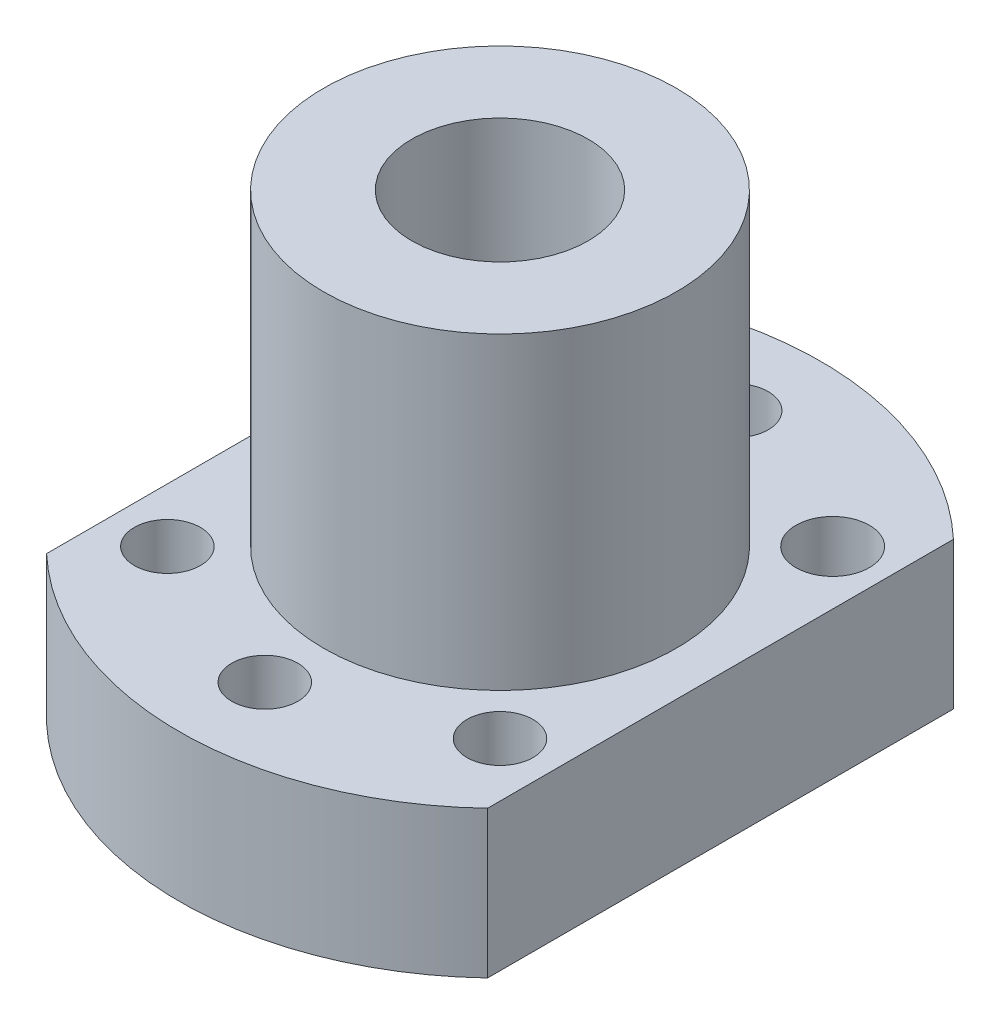
ISO-10303-21;
HEADER;
FILE_DESCRIPTION(('STEP AP214'),'2;1');
FILE_NAME('part.step','',(''),(''),'','','');
FILE_SCHEMA(('AUTOMOTIVE_DESIGN { 1 0 10303 214 1 1 1 1 }'));
ENDSEC;
DATA;
#1=APPLICATION_CONTEXT('core data for automotive mechanical design processes');
#2=APPLICATION_PROTOCOL_DEFINITION('international standard','automotive_design',2000,#1);
#3=PRODUCT_CONTEXT('',#1,'mechanical');
#4=PRODUCT('Part','Part','',(#3));
#5=PRODUCT_RELATED_PRODUCT_CATEGORY('part','',(#4));
#6=PRODUCT_DEFINITION_FORMATION('','',#4);
#7=PRODUCT_DEFINITION_CONTEXT('part definition',#1,'design');
#8=PRODUCT_DEFINITION('design','',#6,#7);
#9=PRODUCT_DEFINITION_SHAPE('','',#8);
#10=(LENGTH_UNIT() NAMED_UNIT(*) SI_UNIT(.MILLI.,.METRE.));
#11=(NAMED_UNIT(*) PLANE_ANGLE_UNIT() SI_UNIT($,.RADIAN.));
#12=(NAMED_UNIT(*) SI_UNIT($,.STERADIAN.) SOLID_ANGLE_UNIT());
#13=UNCERTAINTY_MEASURE_WITH_UNIT(LENGTH_MEASURE(1.E-05),#10,'distance_accuracy_value','');
#14=(GEOMETRIC_REPRESENTATION_CONTEXT(3) GLOBAL_UNCERTAINTY_ASSIGNED_CONTEXT((#13)) GLOBAL_UNIT_ASSIGNED_CONTEXT((#10,
#11,#12)) REPRESENTATION_CONTEXT('',''));
#15=CARTESIAN_POINT('',(0.,0.,0.));
#16=DIRECTION('',(0.,0.,1.));
#17=DIRECTION('',(1.,0.,0.));
#18=AXIS2_PLACEMENT_3D('',#15,#16,#17);
#19=CARTESIAN_POINT('',(0.,10.,0.));
#20=DIRECTION('',(0.,1.,0.));
#21=DIRECTION('',(0.,0.,1.));
#22=AXIS2_PLACEMENT_3D('',#19,#20,#21);
#23=PLANE('',#22);
#24=CARTESIAN_POINT('',(11.3137084989848,10.,11.3137084989847));
#25=DIRECTION('',(0.,1.,0.));
#26=DIRECTION('',(0.,0.,1.));
#27=AXIS2_PLACEMENT_3D('',#24,#25,#26);
#28=CIRCLE('',#27,2.25);
#29=CARTESIAN_POINT('',(11.3137084989848,10.,13.5637084989847));
#30=VERTEX_POINT('',#29);
#31=EDGE_CURVE('E121',#30,#30,#28,.T.);
#32=ORIENTED_EDGE('',*,*,#31,.F.);
#33=EDGE_LOOP('',(#32));
#34=FACE_BOUND('',#33,.T.);
#35=CARTESIAN_POINT('',(0.,10.,16.));
#36=DIRECTION('',(0.,1.,0.));
#37=DIRECTION('',(0.,0.,1.));
#38=AXIS2_PLACEMENT_3D('',#35,#36,#37);
#39=CIRCLE('',#38,2.25);
#40=CARTESIAN_POINT('',(0.,10.,18.25));
#41=VERTEX_POINT('',#40);
#42=EDGE_CURVE('E118',#41,#41,#39,.T.);
#43=ORIENTED_EDGE('',*,*,#42,.F.);
#44=EDGE_LOOP('',(#43));
#45=FACE_BOUND('',#44,.T.);
#46=CARTESIAN_POINT('',(-11.3137084989848,10.,11.3137084989847));
#47=DIRECTION('',(0.,1.,0.));
#48=DIRECTION('',(0.,0.,1.));
#49=AXIS2_PLACEMENT_3D('',#46,#47,#48);
#50=CIRCLE('',#49,2.25);
#51=CARTESIAN_POINT('',(-11.3137084989848,10.,13.5637084989847));
#52=VERTEX_POINT('',#51);
#53=EDGE_CURVE('E115',#52,#52,#50,.T.);
#54=ORIENTED_EDGE('',*,*,#53,.F.);
#55=EDGE_LOOP('',(#54));
#56=FACE_BOUND('',#55,.T.);
#57=CARTESIAN_POINT('',(-11.3137084989848,10.,-11.3137084989847));
#58=DIRECTION('',(0.,1.,0.));
#59=DIRECTION('',(0.,0.,1.));
#60=AXIS2_PLACEMENT_3D('',#57,#58,#59);
#61=CIRCLE('',#60,2.25);
#62=CARTESIAN_POINT('',(-11.3137084989848,10.,-9.06370849898473));
#63=VERTEX_POINT('',#62);
#64=EDGE_CURVE('E112',#63,#63,#61,.T.);
#65=ORIENTED_EDGE('',*,*,#64,.F.);
#66=EDGE_LOOP('',(#65));
#67=FACE_BOUND('',#66,.T.);
#68=CARTESIAN_POINT('',(0.,10.,-16.));
#69=DIRECTION('',(0.,1.,0.));
#70=DIRECTION('',(0.,0.,1.));
#71=AXIS2_PLACEMENT_3D('',#68,#69,#70);
#72=CIRCLE('',#71,2.25);
#73=CARTESIAN_POINT('',(0.,10.,-13.75));
#74=VERTEX_POINT('',#73);
#75=EDGE_CURVE('E109',#74,#74,#72,.T.);
#76=ORIENTED_EDGE('',*,*,#75,.F.);
#77=EDGE_LOOP('',(#76));
#78=FACE_BOUND('',#77,.T.);
#79=CARTESIAN_POINT('',(11.3137084989848,10.,-11.3137084989847));
#80=DIRECTION('',(0.,1.,0.));
#81=DIRECTION('',(0.,0.,1.));
#82=AXIS2_PLACEMENT_3D('',#79,#80,#81);
#83=CIRCLE('',#82,2.5);
#84=CARTESIAN_POINT('',(11.3137084989848,10.,-8.81370849898474));
#85=VERTEX_POINT('',#84);
#86=EDGE_CURVE('E106',#85,#85,#83,.T.);
#87=ORIENTED_EDGE('',*,*,#86,.F.);
#88=EDGE_LOOP('',(#87));
#89=FACE_BOUND('',#88,.T.);
#90=CARTESIAN_POINT('',(0.,10.,0.));
#91=DIRECTION('',(0.,1.,0.));
#92=DIRECTION('',(0.,0.,1.));
#93=AXIS2_PLACEMENT_3D('',#90,#91,#92);
#94=CIRCLE('',#93,21.8198063393168);
#95=CARTESIAN_POINT('',(-15.,10.,15.8462597695889));
#96=VERTEX_POINT('',#95);
#97=CARTESIAN_POINT('',(15.,10.,15.8462597695889));
#98=VERTEX_POINT('',#97);
#99=EDGE_CURVE('E84',#96,#98,#94,.T.);
#100=ORIENTED_EDGE('',*,*,#99,.T.);
#101=DIRECTION('',(0.,0.,1.));
#102=VECTOR('',#101,1.);
#103=CARTESIAN_POINT('',(15.,10.,0.));
#104=LINE('',#103,#102);
#105=CARTESIAN_POINT('',(15.,10.,-15.8462597695889));
#106=VERTEX_POINT('',#105);
#107=EDGE_CURVE('E92',#106,#98,#104,.T.);
#108=ORIENTED_EDGE('',*,*,#107,.F.);
#109=CARTESIAN_POINT('',(0.,10.,0.));
#110=DIRECTION('',(0.,1.,0.));
#111=DIRECTION('',(0.,0.,1.));
#112=AXIS2_PLACEMENT_3D('',#109,#110,#111);
#113=CIRCLE('',#112,21.8198063393168);
#114=CARTESIAN_POINT('',(-15.,10.,-15.8462597695889));
#115=VERTEX_POINT('',#114);
#116=EDGE_CURVE('E96',#106,#115,#113,.T.);
#117=ORIENTED_EDGE('',*,*,#116,.T.);
#118=DIRECTION('',(0.,0.,1.));
#119=VECTOR('',#118,1.);
#120=CARTESIAN_POINT('',(-15.,10.,0.));
#121=LINE('',#120,#119);
#122=EDGE_CURVE('E58',#115,#96,#121,.T.);
#123=ORIENTED_EDGE('',*,*,#122,.T.);
#124=EDGE_LOOP('',(#100,#108,#117,#123));
#125=FACE_BOUND('',#124,.T.);
#126=CARTESIAN_POINT('',(0.,10.,0.));
#127=DIRECTION('',(0.,1.,0.));
#128=DIRECTION('',(0.,0.,1.));
#129=AXIS2_PLACEMENT_3D('',#126,#127,#128);
#130=CIRCLE('',#129,12.);
#131=CARTESIAN_POINT('',(0.,10.,12.));
#132=VERTEX_POINT('',#131);
#133=EDGE_CURVE('E348',#132,#132,#130,.T.);
#134=ORIENTED_EDGE('',*,*,#133,.F.);
#135=EDGE_LOOP('',(#134));
#136=FACE_BOUND('',#135,.T.);
#137=ADVANCED_FACE('F41',(#34,#45,#56,#67,#78,#89,#125,#136),#23,.T.);
#138=CARTESIAN_POINT('',(0.,10.,0.));
#139=DIRECTION('',(0.,-1.,0.));
#140=DIRECTION('',(0.,0.,-1.));
#141=AXIS2_PLACEMENT_3D('',#138,#139,#140);
#142=CYLINDRICAL_SURFACE('',#141,21.8198063393168);
#143=CARTESIAN_POINT('',(0.,0.,0.));
#144=DIRECTION('',(0.,1.,0.));
#145=DIRECTION('',(0.,0.,1.));
#146=AXIS2_PLACEMENT_3D('',#143,#144,#145);
#147=CIRCLE('',#146,21.8198063393168);
#148=CARTESIAN_POINT('',(-15.,0.,15.8462597695889));
#149=VERTEX_POINT('',#148);
#150=CARTESIAN_POINT('',(15.,0.,15.8462597695889));
#151=VERTEX_POINT('',#150);
#152=EDGE_CURVE('E125',#149,#151,#147,.T.);
#153=ORIENTED_EDGE('',*,*,#152,.T.);
#154=DIRECTION('',(0.,-1.,0.));
#155=VECTOR('',#154,1.);
#156=CARTESIAN_POINT('',(15.,10.,15.8462597695889));
#157=LINE('',#156,#155);
#158=EDGE_CURVE('E11',#98,#151,#157,.T.);
#159=ORIENTED_EDGE('',*,*,#158,.F.);
#160=ORIENTED_EDGE('',*,*,#99,.F.);
#161=DIRECTION('',(0.,-1.,0.));
#162=VECTOR('',#161,1.);
#163=CARTESIAN_POINT('',(-15.,10.,15.8462597695889));
#164=LINE('',#163,#162);
#165=EDGE_CURVE('E124',#96,#149,#164,.T.);
#166=ORIENTED_EDGE('',*,*,#165,.T.);
#167=EDGE_LOOP('',(#153,#159,#160,#166));
#168=FACE_BOUND('',#167,.T.);
#169=ADVANCED_FACE('F43',(#168),#142,.T.);
#170=CARTESIAN_POINT('',(15.,10.,0.));
#171=DIRECTION('',(1.,0.,0.));
#172=DIRECTION('',(0.,0.,-1.));
#173=AXIS2_PLACEMENT_3D('',#170,#171,#172);
#174=PLANE('',#173);
#175=DIRECTION('',(0.,0.,1.));
#176=VECTOR('',#175,1.);
#177=CARTESIAN_POINT('',(15.,0.,0.));
#178=LINE('',#177,#176);
#179=CARTESIAN_POINT('',(15.,0.,-15.8462597695889));
#180=VERTEX_POINT('',#179);
#181=EDGE_CURVE('E94',#180,#151,#178,.T.);
#182=ORIENTED_EDGE('',*,*,#181,.F.);
#183=DIRECTION('',(0.,-1.,0.));
#184=VECTOR('',#183,1.);
#185=CARTESIAN_POINT('',(15.,10.,-15.8462597695889));
#186=LINE('',#185,#184);
#187=EDGE_CURVE('E50',#106,#180,#186,.T.);
#188=ORIENTED_EDGE('',*,*,#187,.F.);
#189=ORIENTED_EDGE('',*,*,#107,.T.);
#190=ORIENTED_EDGE('',*,*,#158,.T.);
#191=EDGE_LOOP('',(#182,#188,#189,#190));
#192=FACE_BOUND('',#191,.T.);
#193=ADVANCED_FACE('F91',(#192),#174,.T.);
#194=CARTESIAN_POINT('',(0.,10.,0.));
#195=DIRECTION('',(0.,-1.,0.));
#196=DIRECTION('',(0.,0.,-1.));
#197=AXIS2_PLACEMENT_3D('',#194,#195,#196);
#198=CYLINDRICAL_SURFACE('',#197,21.8198063393168);
#199=CARTESIAN_POINT('',(0.,0.,0.));
#200=DIRECTION('',(0.,1.,0.));
#201=DIRECTION('',(0.,0.,1.));
#202=AXIS2_PLACEMENT_3D('',#199,#200,#201);
#203=CIRCLE('',#202,21.8198063393168);
#204=CARTESIAN_POINT('',(-15.,0.,-15.8462597695889));
#205=VERTEX_POINT('',#204);
#206=EDGE_CURVE('E73',#180,#205,#203,.T.);
#207=ORIENTED_EDGE('',*,*,#206,.T.);
#208=DIRECTION('',(0.,-1.,0.));
#209=VECTOR('',#208,1.);
#210=CARTESIAN_POINT('',(-15.,10.,-15.8462597695889));
#211=LINE('',#210,#209);
#212=EDGE_CURVE('E95',#115,#205,#211,.T.);
#213=ORIENTED_EDGE('',*,*,#212,.F.);
#214=ORIENTED_EDGE('',*,*,#116,.F.);
#215=ORIENTED_EDGE('',*,*,#187,.T.);
#216=EDGE_LOOP('',(#207,#213,#214,#215));
#217=FACE_BOUND('',#216,.T.);
#218=ADVANCED_FACE('F97',(#217),#198,.T.);
#219=CARTESIAN_POINT('',(0.,10.,0.));
#220=DIRECTION('',(0.,-1.,0.));
#221=DIRECTION('',(0.,0.,-1.));
#222=AXIS2_PLACEMENT_3D('',#219,#220,#221);
#223=CYLINDRICAL_SURFACE('',#222,6.);
#224=CARTESIAN_POINT('',(0.,0.,0.));
#225=DIRECTION('',(0.,1.,0.));
#226=DIRECTION('',(0.,0.,1.));
#227=AXIS2_PLACEMENT_3D('',#224,#225,#226);
#228=CIRCLE('',#227,6.);
#229=CARTESIAN_POINT('',(0.,0.,6.));
#230=VERTEX_POINT('',#229);
#231=EDGE_CURVE('E147',#230,#230,#228,.T.);
#232=ORIENTED_EDGE('',*,*,#231,.F.);
#233=EDGE_LOOP('',(#232));
#234=FACE_BOUND('',#233,.T.);
#235=CARTESIAN_POINT('',(0.,31.,0.));
#236=DIRECTION('',(0.,1.,0.));
#237=DIRECTION('',(0.,0.,1.));
#238=AXIS2_PLACEMENT_3D('',#235,#236,#237);
#239=CIRCLE('',#238,6.);
#240=CARTESIAN_POINT('',(0.,31.,6.));
#241=VERTEX_POINT('',#240);
#242=EDGE_CURVE('E349',#241,#241,#239,.T.);
#243=ORIENTED_EDGE('',*,*,#242,.T.);
#244=EDGE_LOOP('',(#243));
#245=FACE_BOUND('',#244,.T.);
#246=ADVANCED_FACE('F181',(#234,#245),#223,.F.);
#247=CARTESIAN_POINT('',(0.,10.,16.));
#248=DIRECTION('',(0.,-1.,0.));
#249=DIRECTION('',(0.,0.,-1.));
#250=AXIS2_PLACEMENT_3D('',#247,#248,#249);
#251=CYLINDRICAL_SURFACE('',#250,2.25);
#252=ORIENTED_EDGE('',*,*,#42,.T.);
#253=EDGE_LOOP('',(#252));
#254=FACE_BOUND('',#253,.T.);
#255=CARTESIAN_POINT('',(0.,0.,16.));
#256=DIRECTION('',(0.,1.,0.));
#257=DIRECTION('',(0.,0.,1.));
#258=AXIS2_PLACEMENT_3D('',#255,#256,#257);
#259=CIRCLE('',#258,2.25);
#260=CARTESIAN_POINT('',(0.,0.,18.25));
#261=VERTEX_POINT('',#260);
#262=EDGE_CURVE('E144',#261,#261,#259,.T.);
#263=ORIENTED_EDGE('',*,*,#262,.F.);
#264=EDGE_LOOP('',(#263));
#265=FACE_BOUND('',#264,.T.);
#266=ADVANCED_FACE('F184',(#254,#265),#251,.F.);
#267=CARTESIAN_POINT('',(-11.3137084989848,10.,11.3137084989847));
#268=DIRECTION('',(0.,-1.,0.));
#269=DIRECTION('',(0.,0.,-1.));
#270=AXIS2_PLACEMENT_3D('',#267,#268,#269);
#271=CYLINDRICAL_SURFACE('',#270,2.25);
#272=ORIENTED_EDGE('',*,*,#53,.T.);
#273=EDGE_LOOP('',(#272));
#274=FACE_BOUND('',#273,.T.);
#275=CARTESIAN_POINT('',(-11.3137084989848,0.,11.3137084989847));
#276=DIRECTION('',(0.,1.,0.));
#277=DIRECTION('',(0.,0.,1.));
#278=AXIS2_PLACEMENT_3D('',#275,#276,#277);
#279=CIRCLE('',#278,2.25);
#280=CARTESIAN_POINT('',(-11.3137084989848,0.,13.5637084989847));
#281=VERTEX_POINT('',#280);
#282=EDGE_CURVE('E141',#281,#281,#279,.T.);
#283=ORIENTED_EDGE('',*,*,#282,.F.);
#284=EDGE_LOOP('',(#283));
#285=FACE_BOUND('',#284,.T.);
#286=ADVANCED_FACE('F188',(#274,#285),#271,.F.);
#287=CARTESIAN_POINT('',(-11.3137084989848,10.,-11.3137084989847));
#288=DIRECTION('',(0.,-1.,0.));
#289=DIRECTION('',(0.,0.,-1.));
#290=AXIS2_PLACEMENT_3D('',#287,#288,#289);
#291=CYLINDRICAL_SURFACE('',#290,2.25);
#292=ORIENTED_EDGE('',*,*,#64,.T.);
#293=EDGE_LOOP('',(#292));
#294=FACE_BOUND('',#293,.T.);
#295=CARTESIAN_POINT('',(-11.3137084989848,0.,-11.3137084989847));
#296=DIRECTION('',(0.,1.,0.));
#297=DIRECTION('',(0.,0.,1.));
#298=AXIS2_PLACEMENT_3D('',#295,#296,#297);
#299=CIRCLE('',#298,2.25);
#300=CARTESIAN_POINT('',(-11.3137084989848,0.,-9.06370849898473));
#301=VERTEX_POINT('',#300);
#302=EDGE_CURVE('E138',#301,#301,#299,.T.);
#303=ORIENTED_EDGE('',*,*,#302,.F.);
#304=EDGE_LOOP('',(#303));
#305=FACE_BOUND('',#304,.T.);
#306=ADVANCED_FACE('F192',(#294,#305),#291,.F.);
#307=CARTESIAN_POINT('',(0.,10.,-16.));
#308=DIRECTION('',(0.,-1.,0.));
#309=DIRECTION('',(0.,0.,-1.));
#310=AXIS2_PLACEMENT_3D('',#307,#308,#309);
#311=CYLINDRICAL_SURFACE('',#310,2.25);
#312=ORIENTED_EDGE('',*,*,#75,.T.);
#313=EDGE_LOOP('',(#312));
#314=FACE_BOUND('',#313,.T.);
#315=CARTESIAN_POINT('',(0.,0.,-16.));
#316=DIRECTION('',(0.,1.,0.));
#317=DIRECTION('',(0.,0.,1.));
#318=AXIS2_PLACEMENT_3D('',#315,#316,#317);
#319=CIRCLE('',#318,2.25);
#320=CARTESIAN_POINT('',(0.,0.,-13.75));
#321=VERTEX_POINT('',#320);
#322=EDGE_CURVE('E135',#321,#321,#319,.T.);
#323=ORIENTED_EDGE('',*,*,#322,.F.);
#324=EDGE_LOOP('',(#323));
#325=FACE_BOUND('',#324,.T.);
#326=ADVANCED_FACE('F196',(#314,#325),#311,.F.);
#327=CARTESIAN_POINT('',(11.3137084989848,10.,-11.3137084989847));
#328=DIRECTION('',(0.,-1.,0.));
#329=DIRECTION('',(0.,0.,-1.));
#330=AXIS2_PLACEMENT_3D('',#327,#328,#329);
#331=CYLINDRICAL_SURFACE('',#330,2.5);
#332=ORIENTED_EDGE('',*,*,#86,.T.);
#333=EDGE_LOOP('',(#332));
#334=FACE_BOUND('',#333,.T.);
#335=CARTESIAN_POINT('',(11.3137084989848,0.,-11.3137084989847));
#336=DIRECTION('',(0.,1.,0.));
#337=DIRECTION('',(0.,0.,1.));
#338=AXIS2_PLACEMENT_3D('',#335,#336,#337);
#339=CIRCLE('',#338,2.5);
#340=CARTESIAN_POINT('',(11.3137084989848,0.,-8.81370849898474));
#341=VERTEX_POINT('',#340);
#342=EDGE_CURVE('E132',#341,#341,#339,.T.);
#343=ORIENTED_EDGE('',*,*,#342,.F.);
#344=EDGE_LOOP('',(#343));
#345=FACE_BOUND('',#344,.T.);
#346=ADVANCED_FACE('F200',(#334,#345),#331,.F.);
#347=CARTESIAN_POINT('',(-15.,10.,0.));
#348=DIRECTION('',(1.,0.,0.));
#349=DIRECTION('',(0.,0.,-1.));
#350=AXIS2_PLACEMENT_3D('',#347,#348,#349);
#351=PLANE('',#350);
#352=DIRECTION('',(0.,0.,1.));
#353=VECTOR('',#352,1.);
#354=CARTESIAN_POINT('',(-15.,0.,0.));
#355=LINE('',#354,#353);
#356=EDGE_CURVE('E79',#205,#149,#355,.T.);
#357=ORIENTED_EDGE('',*,*,#356,.T.);
#358=ORIENTED_EDGE('',*,*,#165,.F.);
#359=ORIENTED_EDGE('',*,*,#122,.F.);
#360=ORIENTED_EDGE('',*,*,#212,.T.);
#361=EDGE_LOOP('',(#357,#358,#359,#360));
#362=FACE_BOUND('',#361,.T.);
#363=ADVANCED_FACE('F153',(#362),#351,.F.);
#364=CARTESIAN_POINT('',(11.3137084989848,10.,11.3137084989847));
#365=DIRECTION('',(0.,-1.,0.));
#366=DIRECTION('',(0.,0.,-1.));
#367=AXIS2_PLACEMENT_3D('',#364,#365,#366);
#368=CYLINDRICAL_SURFACE('',#367,2.25);
#369=ORIENTED_EDGE('',*,*,#31,.T.);
#370=EDGE_LOOP('',(#369));
#371=FACE_BOUND('',#370,.T.);
#372=CARTESIAN_POINT('',(11.3137084989848,0.,11.3137084989847));
#373=DIRECTION('',(0.,1.,0.));
#374=DIRECTION('',(0.,0.,1.));
#375=AXIS2_PLACEMENT_3D('',#372,#373,#374);
#376=CIRCLE('',#375,2.25);
#377=CARTESIAN_POINT('',(11.3137084989848,0.,13.5637084989847));
#378=VERTEX_POINT('',#377);
#379=EDGE_CURVE('E101',#378,#378,#376,.T.);
#380=ORIENTED_EDGE('',*,*,#379,.F.);
#381=EDGE_LOOP('',(#380));
#382=FACE_BOUND('',#381,.T.);
#383=ADVANCED_FACE('F177',(#371,#382),#368,.F.);
#384=CARTESIAN_POINT('',(0.,0.,0.));
#385=DIRECTION('',(0.,1.,0.));
#386=DIRECTION('',(0.,0.,1.));
#387=AXIS2_PLACEMENT_3D('',#384,#385,#386);
#388=PLANE('',#387);
#389=ORIENTED_EDGE('',*,*,#152,.F.);
#390=ORIENTED_EDGE('',*,*,#356,.F.);
#391=ORIENTED_EDGE('',*,*,#206,.F.);
#392=ORIENTED_EDGE('',*,*,#181,.T.);
#393=EDGE_LOOP('',(#389,#390,#391,#392));
#394=FACE_BOUND('',#393,.T.);
#395=ORIENTED_EDGE('',*,*,#342,.T.);
#396=EDGE_LOOP('',(#395));
#397=FACE_BOUND('',#396,.T.);
#398=ORIENTED_EDGE('',*,*,#322,.T.);
#399=EDGE_LOOP('',(#398));
#400=FACE_BOUND('',#399,.T.);
#401=ORIENTED_EDGE('',*,*,#302,.T.);
#402=EDGE_LOOP('',(#401));
#403=FACE_BOUND('',#402,.T.);
#404=ORIENTED_EDGE('',*,*,#282,.T.);
#405=EDGE_LOOP('',(#404));
#406=FACE_BOUND('',#405,.T.);
#407=ORIENTED_EDGE('',*,*,#262,.T.);
#408=EDGE_LOOP('',(#407));
#409=FACE_BOUND('',#408,.T.);
#410=ORIENTED_EDGE('',*,*,#231,.T.);
#411=EDGE_LOOP('',(#410));
#412=FACE_BOUND('',#411,.T.);
#413=ORIENTED_EDGE('',*,*,#379,.T.);
#414=EDGE_LOOP('',(#413));
#415=FACE_BOUND('',#414,.T.);
#416=ADVANCED_FACE('F156',(#394,#397,#400,#403,#406,#409,#412,#415),#388,.F.);
#417=CARTESIAN_POINT('',(0.,31.,0.));
#418=DIRECTION('',(0.,1.,0.));
#419=DIRECTION('',(0.,0.,1.));
#420=AXIS2_PLACEMENT_3D('',#417,#418,#419);
#421=PLANE('',#420);
#422=CARTESIAN_POINT('',(0.,31.,0.));
#423=DIRECTION('',(0.,1.,0.));
#424=DIRECTION('',(0.,0.,1.));
#425=AXIS2_PLACEMENT_3D('',#422,#423,#424);
#426=CIRCLE('',#425,12.);
#427=CARTESIAN_POINT('',(0.,31.,12.));
#428=VERTEX_POINT('',#427);
#429=EDGE_CURVE('E128',#428,#428,#426,.T.);
#430=ORIENTED_EDGE('',*,*,#429,.T.);
#431=EDGE_LOOP('',(#430));
#432=FACE_BOUND('',#431,.T.);
#433=ORIENTED_EDGE('',*,*,#242,.F.);
#434=EDGE_LOOP('',(#433));
#435=FACE_BOUND('',#434,.T.);
#436=ADVANCED_FACE('F176',(#432,#435),#421,.T.);
#437=CARTESIAN_POINT('',(0.,31.,0.));
#438=DIRECTION('',(0.,-1.,0.));
#439=DIRECTION('',(0.,0.,-1.));
#440=AXIS2_PLACEMENT_3D('',#437,#438,#439);
#441=CYLINDRICAL_SURFACE('',#440,12.);
#442=ORIENTED_EDGE('',*,*,#429,.F.);
#443=EDGE_LOOP('',(#442));
#444=FACE_BOUND('',#443,.T.);
#445=ORIENTED_EDGE('',*,*,#133,.T.);
#446=EDGE_LOOP('',(#445));
#447=FACE_BOUND('',#446,.T.);
#448=ADVANCED_FACE('F172',(#444,#447),#441,.T.);
#449=CLOSED_SHELL('',(#137,#169,#193,#218,#246,#266,#286,#306,#326,#346,#363,#383,#416,#436,#448));
#450=MANIFOLD_SOLID_BREP('B2',#449);
#451=ADVANCED_BREP_SHAPE_REPRESENTATION('',(#18,#450),#14);
#452=SHAPE_DEFINITION_REPRESENTATION(#9,#451);
ENDSEC;
END-ISO-10303-21;
